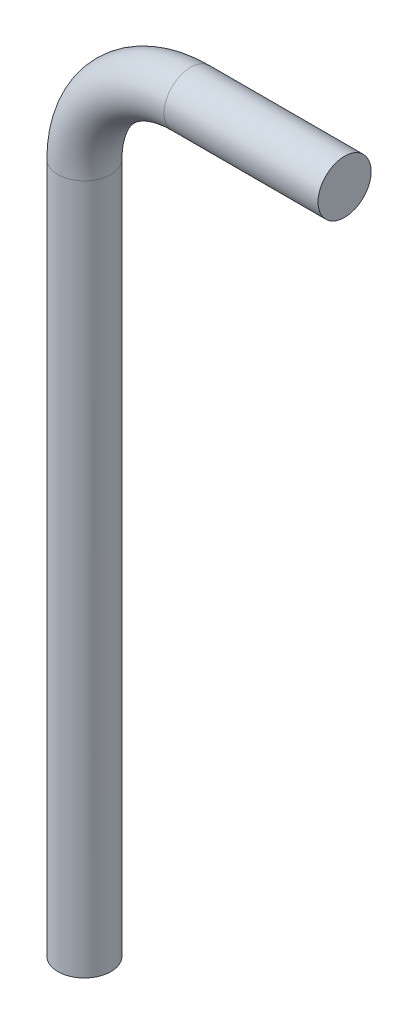
ISO-10303-21;
HEADER;
FILE_DESCRIPTION(('STEP AP214'),'2;1');
FILE_NAME('part.step','',(''),(''),'','','');
FILE_SCHEMA(('AUTOMOTIVE_DESIGN { 1 0 10303 214 1 1 1 1 }'));
ENDSEC;
DATA;
#1=APPLICATION_CONTEXT('core data for automotive mechanical design processes');
#2=APPLICATION_PROTOCOL_DEFINITION('international standard','automotive_design',2000,#1);
#3=PRODUCT_CONTEXT('',#1,'mechanical');
#4=PRODUCT('Part','Part','',(#3));
#5=PRODUCT_RELATED_PRODUCT_CATEGORY('part','',(#4));
#6=PRODUCT_DEFINITION_FORMATION('','',#4);
#7=PRODUCT_DEFINITION_CONTEXT('part definition',#1,'design');
#8=PRODUCT_DEFINITION('design','',#6,#7);
#9=PRODUCT_DEFINITION_SHAPE('','',#8);
#10=(LENGTH_UNIT() NAMED_UNIT(*) SI_UNIT(.MILLI.,.METRE.));
#11=(NAMED_UNIT(*) PLANE_ANGLE_UNIT() SI_UNIT($,.RADIAN.));
#12=(NAMED_UNIT(*) SI_UNIT($,.STERADIAN.) SOLID_ANGLE_UNIT());
#13=UNCERTAINTY_MEASURE_WITH_UNIT(LENGTH_MEASURE(1.E-05),#10,'distance_accuracy_value','');
#14=(GEOMETRIC_REPRESENTATION_CONTEXT(3) GLOBAL_UNCERTAINTY_ASSIGNED_CONTEXT((#13)) GLOBAL_UNIT_ASSIGNED_CONTEXT((#10,
#11,#12)) REPRESENTATION_CONTEXT('',''));
#15=CARTESIAN_POINT('',(0.,0.,0.));
#16=DIRECTION('',(0.,0.,1.));
#17=DIRECTION('',(1.,0.,0.));
#18=AXIS2_PLACEMENT_3D('',#15,#16,#17);
#19=CARTESIAN_POINT('',(24.49747468,75.,0.));
#20=DIRECTION('',(1.,0.,0.));
#21=DIRECTION('',(0.,0.,1.));
#22=AXIS2_PLACEMENT_3D('',#19,#20,#21);
#23=PLANE('',#22);
#24=CARTESIAN_POINT('',(24.49747468,75.,0.));
#25=DIRECTION('',(1.,0.,0.));
#26=DIRECTION('',(0.,0.,1.));
#27=AXIS2_PLACEMENT_3D('',#24,#25,#26);
#28=CIRCLE('',#27,2.5);
#29=CARTESIAN_POINT('',(24.49747468,75.,2.5));
#30=VERTEX_POINT('',#29);
#31=EDGE_CURVE('E54',#30,#30,#28,.T.);
#32=ORIENTED_EDGE('',*,*,#31,.T.);
#33=EDGE_LOOP('',(#32));
#34=FACE_BOUND('',#33,.T.);
#35=ADVANCED_FACE('F37',(#34),#23,.T.);
#36=CARTESIAN_POINT('',(0.,0.,0.));
#37=DIRECTION('',(0.,1.,0.));
#38=DIRECTION('',(0.,0.,1.));
#39=AXIS2_PLACEMENT_3D('',#36,#37,#38);
#40=PLANE('',#39);
#41=CARTESIAN_POINT('',(0.,0.,0.));
#42=DIRECTION('',(0.,1.,0.));
#43=DIRECTION('',(0.,0.,1.));
#44=AXIS2_PLACEMENT_3D('',#41,#42,#43);
#45=CIRCLE('',#44,2.5);
#46=CARTESIAN_POINT('',(0.,0.,2.5));
#47=VERTEX_POINT('',#46);
#48=EDGE_CURVE('E10',#47,#47,#45,.T.);
#49=ORIENTED_EDGE('',*,*,#48,.F.);
#50=EDGE_LOOP('',(#49));
#51=FACE_BOUND('',#50,.T.);
#52=ADVANCED_FACE('F65',(#51),#40,.F.);
#53=CARTESIAN_POINT('',(24.49747468,75.,0.));
#54=DIRECTION('',(-1.,0.,0.));
#55=DIRECTION('',(0.,0.,1.));
#56=AXIS2_PLACEMENT_3D('',#53,#54,#55);
#57=CYLINDRICAL_SURFACE('',#56,2.5);
#58=CARTESIAN_POINT('',(10.0000000000001,75.,0.));
#59=DIRECTION('',(1.,0.,0.));
#60=DIRECTION('',(0.,0.,1.));
#61=AXIS2_PLACEMENT_3D('',#58,#59,#60);
#62=CIRCLE('',#61,2.5);
#63=CARTESIAN_POINT('',(10.0000000000001,77.5,0.));
#64=VERTEX_POINT('',#63);
#65=EDGE_CURVE('E49',#64,#64,#62,.T.);
#66=ORIENTED_EDGE('',*,*,#65,.T.);
#67=EDGE_LOOP('',(#66));
#68=FACE_BOUND('',#67,.T.);
#69=ORIENTED_EDGE('',*,*,#31,.F.);
#70=EDGE_LOOP('',(#69));
#71=FACE_BOUND('',#70,.T.);
#72=ADVANCED_FACE('F62',(#68,#71),#57,.T.);
#73=CARTESIAN_POINT('',(10.,65.,0.));
#74=DIRECTION('',(0.,0.,1.));
#75=DIRECTION('',(1.,0.,0.));
#76=AXIS2_PLACEMENT_3D('',#73,#74,#75);
#77=TOROIDAL_SURFACE('',#76,9.99999999999999,2.5);
#78=CARTESIAN_POINT('',(0.,64.9999999999999,0.));
#79=DIRECTION('',(0.,1.,0.));
#80=DIRECTION('',(0.,0.,1.));
#81=AXIS2_PLACEMENT_3D('',#78,#79,#80);
#82=CIRCLE('',#81,2.5);
#83=CARTESIAN_POINT('',(-2.5,64.9999999999999,0.));
#84=VERTEX_POINT('',#83);
#85=EDGE_CURVE('E44',#84,#84,#82,.T.);
#86=CARTESIAN_POINT('',(10.,65.,0.));
#87=DIRECTION('',(0.,0.,1.));
#88=DIRECTION('',(1.,0.,0.));
#89=AXIS2_PLACEMENT_3D('',#86,#87,#88);
#90=CIRCLE('',#89,12.5);
#91=EDGE_CURVE('',#64,#84,#90,.T.);
#92=ORIENTED_EDGE('',*,*,#65,.F.);
#93=ORIENTED_EDGE('',*,*,#85,.T.);
#94=ORIENTED_EDGE('',*,*,#91,.T.);
#95=ORIENTED_EDGE('',*,*,#91,.F.);
#96=EDGE_LOOP('',(#92,#94,#93,#95));
#97=FACE_BOUND('',#96,.T.);
#98=ADVANCED_FACE('F64',(#97),#77,.T.);
#99=CARTESIAN_POINT('',(0.,64.9999999999999,0.));
#100=DIRECTION('',(0.,-1.,0.));
#101=DIRECTION('',(0.,0.,-1.));
#102=AXIS2_PLACEMENT_3D('',#99,#100,#101);
#103=CYLINDRICAL_SURFACE('',#102,2.5);
#104=ORIENTED_EDGE('',*,*,#48,.T.);
#105=EDGE_LOOP('',(#104));
#106=FACE_BOUND('',#105,.T.);
#107=ORIENTED_EDGE('',*,*,#85,.F.);
#108=EDGE_LOOP('',(#107));
#109=FACE_BOUND('',#108,.T.);
#110=ADVANCED_FACE('F72',(#106,#109),#103,.T.);
#111=CLOSED_SHELL('',(#35,#52,#72,#98,#110));
#112=MANIFOLD_SOLID_BREP('B2',#111);
#113=ADVANCED_BREP_SHAPE_REPRESENTATION('',(#18,#112),#14);
#114=SHAPE_DEFINITION_REPRESENTATION(#9,#113);
ENDSEC;
END-ISO-10303-21;
